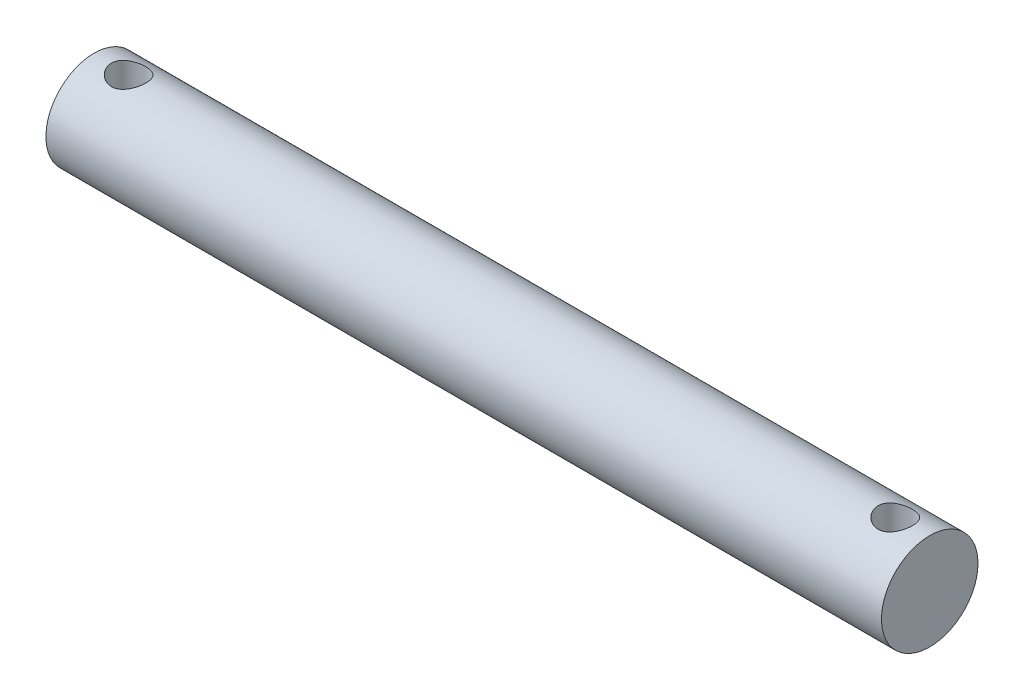
ISO-10303-21;
HEADER;
FILE_DESCRIPTION(('STEP AP214'),'2;1');
FILE_NAME('part.step','',(''),(''),'','','');
FILE_SCHEMA(('AUTOMOTIVE_DESIGN { 1 0 10303 214 1 1 1 1 }'));
ENDSEC;
DATA;
#1=APPLICATION_CONTEXT('core data for automotive mechanical design processes');
#2=APPLICATION_PROTOCOL_DEFINITION('international standard','automotive_design',2000,#1);
#3=PRODUCT_CONTEXT('',#1,'mechanical');
#4=PRODUCT('Part','Part','',(#3));
#5=PRODUCT_RELATED_PRODUCT_CATEGORY('part','',(#4));
#6=PRODUCT_DEFINITION_FORMATION('','',#4);
#7=PRODUCT_DEFINITION_CONTEXT('part definition',#1,'design');
#8=PRODUCT_DEFINITION('design','',#6,#7);
#9=PRODUCT_DEFINITION_SHAPE('','',#8);
#10=(LENGTH_UNIT() NAMED_UNIT(*) SI_UNIT(.MILLI.,.METRE.));
#11=(NAMED_UNIT(*) PLANE_ANGLE_UNIT() SI_UNIT($,.RADIAN.));
#12=(NAMED_UNIT(*) SI_UNIT($,.STERADIAN.) SOLID_ANGLE_UNIT());
#13=UNCERTAINTY_MEASURE_WITH_UNIT(LENGTH_MEASURE(1.E-05),#10,'distance_accuracy_value','');
#14=(GEOMETRIC_REPRESENTATION_CONTEXT(3) GLOBAL_UNCERTAINTY_ASSIGNED_CONTEXT((#13)) GLOBAL_UNIT_ASSIGNED_CONTEXT((#10,
#11,#12)) REPRESENTATION_CONTEXT('',''));
#15=CARTESIAN_POINT('',(0.,0.,0.));
#16=DIRECTION('',(0.,0.,1.));
#17=DIRECTION('',(1.,0.,0.));
#18=AXIS2_PLACEMENT_3D('',#15,#16,#17);
#19=CARTESIAN_POINT('',(38.481,0.,0.));
#20=DIRECTION('',(-1.,0.,0.));
#21=DIRECTION('',(0.,0.,1.));
#22=AXIS2_PLACEMENT_3D('',#19,#20,#21);
#23=CYLINDRICAL_SURFACE('',#22,4.445);
#24=CARTESIAN_POINT('',(-35.306,-4.15185124372249,1.5875));
#25=CARTESIAN_POINT('',(-35.2199403153724,-4.15184961363661,1.58750186145511));
#26=CARTESIAN_POINT('',(-35.1338934965686,-4.15455616835706,1.58047848396243));
#27=CARTESIAN_POINT('',(-34.9643744964137,-4.16502288196892,1.55268356499295));
#28=CARTESIAN_POINT('',(-34.8809024424381,-4.17278329045961,1.53191134448871));
#29=CARTESIAN_POINT('',(-34.7190220280101,-4.19236894394199,1.47746203514562));
#30=CARTESIAN_POINT('',(-34.6406029711052,-4.20418524334939,1.44381332779936));
#31=CARTESIAN_POINT('',(-34.4904943483124,-4.23053749931584,1.36466530894206));
#32=CARTESIAN_POINT('',(-34.4188065931905,-4.24507418454743,1.3191628210377));
#33=CARTESIAN_POINT('',(-34.2809695386923,-4.27596256981786,1.21540554219155));
#34=CARTESIAN_POINT('',(-34.2151666075899,-4.29236418275633,1.15670535812412));
#35=CARTESIAN_POINT('',(-34.094098151087,-4.32471563521184,1.02916641510783));
#36=CARTESIAN_POINT('',(-34.0388346150267,-4.34066538895641,0.960325746451902));
#37=CARTESIAN_POINT('',(-33.9387884298486,-4.37090247101428,0.81187345728735));
#38=CARTESIAN_POINT('',(-33.8943762723068,-4.38512436926321,0.731997639191119));
#39=CARTESIAN_POINT('',(-33.8197602397867,-4.40970864795004,0.565311965269056));
#40=CARTESIAN_POINT('',(-33.7895519277029,-4.42007223346618,0.478504284797408));
#41=CARTESIAN_POINT('',(-33.745397997512,-4.43541824115144,0.304056241422309));
#42=CARTESIAN_POINT('',(-33.7308573792504,-4.44059696934818,0.216584076105372));
#43=CARTESIAN_POINT('',(-33.7165515724594,-4.44569086669573,0.0402981929925169));
#44=CARTESIAN_POINT('',(-33.7167820229602,-4.44560758938665,-0.0485151211045228));
#45=CARTESIAN_POINT('',(-33.7316516104535,-4.44031535586951,-0.220721157169038));
#46=CARTESIAN_POINT('',(-33.7456427615527,-4.43533691376078,-0.304178113904802));
#47=CARTESIAN_POINT('',(-33.7865547604759,-4.42111035951306,-0.467470573630688));
#48=CARTESIAN_POINT('',(-33.8134765111196,-4.41186194924493,-0.547305823325742));
#49=CARTESIAN_POINT('',(-33.8798197915494,-4.38985982444158,-0.702412213924163));
#50=CARTESIAN_POINT('',(-33.919411312042,-4.37705877358586,-0.777603652980376));
#51=CARTESIAN_POINT('',(-34.0098247539622,-4.34926332268646,-0.920454849377235));
#52=CARTESIAN_POINT('',(-34.0606500975727,-4.33426825474632,-0.988112302158894));
#53=CARTESIAN_POINT('',(-34.1752750427185,-4.3026987456317,-1.11781112500373));
#54=CARTESIAN_POINT('',(-34.2396234827347,-4.28608272826663,-1.17935805699104));
#55=CARTESIAN_POINT('',(-34.3778481145109,-4.25380126113165,-1.29096205409802));
#56=CARTESIAN_POINT('',(-34.4517262573262,-4.23813600698386,-1.3410167605171));
#57=CARTESIAN_POINT('',(-34.6086923089919,-4.20928243980775,-1.42904147223294));
#58=CARTESIAN_POINT('',(-34.691925197268,-4.19614525667899,-1.46677102986788));
#59=CARTESIAN_POINT('',(-34.8641539520802,-4.17442484654723,-1.52749952679716));
#60=CARTESIAN_POINT('',(-34.9531469433922,-4.16583936688029,-1.55050575392142));
#61=CARTESIAN_POINT('',(-35.1295232674423,-4.1547161351662,-1.58006234701041));
#62=CARTESIAN_POINT('',(-35.216758251045,-4.15189299388976,-1.58739017478792));
#63=CARTESIAN_POINT('',(-35.3912381932682,-4.15181045854302,-1.5876073013021));
#64=CARTESIAN_POINT('',(-35.478483145569,-4.15454985177955,-1.58049974710939));
#65=CARTESIAN_POINT('',(-35.6467243469504,-4.16499614614501,-1.55275025711288));
#66=CARTESIAN_POINT('',(-35.727829702171,-4.17249240143436,-1.53268163102879));
#67=CARTESIAN_POINT('',(-35.8854945960213,-4.19136588020112,-1.48028611708297));
#68=CARTESIAN_POINT('',(-35.9620532535496,-4.20274385305131,-1.44795686214945));
#69=CARTESIAN_POINT('',(-36.1114341127048,-4.22859135152075,-1.37067546211526));
#70=CARTESIAN_POINT('',(-36.1840309628719,-4.24315534286961,-1.32532021898191));
#71=CARTESIAN_POINT('',(-36.32086190271,-4.27356458881016,-1.2237152069167));
#72=CARTESIAN_POINT('',(-36.3850931740309,-4.28941027230238,-1.16746178220034));
#73=CARTESIAN_POINT('',(-36.5071296081476,-4.32168024689205,-1.04188922622757));
#74=CARTESIAN_POINT('',(-36.5643664097688,-4.33808662434348,-0.972011338061232));
#75=CARTESIAN_POINT('',(-36.6663558550072,-4.36876018149844,-0.823237586208087));
#76=CARTESIAN_POINT('',(-36.7111087072934,-4.3830273969562,-0.744341873285213));
#77=CARTESIAN_POINT('',(-36.7865026418642,-4.40777619941438,-0.579996600943282));
#78=CARTESIAN_POINT('',(-36.8172149210875,-4.41827682623921,-0.494582728970091));
#79=CARTESIAN_POINT('',(-36.8636847555013,-4.43438493349275,-0.319345880815307));
#80=CARTESIAN_POINT('',(-36.8794486082962,-4.43999447440086,-0.229524778139306));
#81=CARTESIAN_POINT('',(-36.8949433338191,-4.44551042495457,-0.053186018396698));
#82=CARTESIAN_POINT('',(-36.8954850775951,-4.44570526545826,0.0332520607219783));
#83=CARTESIAN_POINT('',(-36.8825682356134,-4.44110341833066,0.204931520344084));
#84=CARTESIAN_POINT('',(-36.8691110823032,-4.43630724140882,0.290173022383648));
#85=CARTESIAN_POINT('',(-36.8291363178973,-4.42238327531985,0.455283139679928));
#86=CARTESIAN_POINT('',(-36.802891390661,-4.4133460633109,0.535225978059553));
#87=CARTESIAN_POINT('',(-36.7383484873859,-4.39187518688631,0.689591860756163));
#88=CARTESIAN_POINT('',(-36.7000482528469,-4.37944088610115,0.764013867542668));
#89=CARTESIAN_POINT('',(-36.6107272912744,-4.35181686458272,0.908483284677039));
#90=CARTESIAN_POINT('',(-36.5592585583125,-4.33653673686909,0.978236136617502));
#91=CARTESIAN_POINT('',(-36.4457916884133,-4.30511614240119,1.10837248020741));
#92=CARTESIAN_POINT('',(-36.3837899528847,-4.28897538291027,1.16875275618678));
#93=CARTESIAN_POINT('',(-36.2475660447444,-4.25674081239818,1.28131710248981));
#94=CARTESIAN_POINT('',(-36.1729084278387,-4.24068438756024,1.33298679430306));
#95=CARTESIAN_POINT('',(-36.015461106913,-4.21132223267718,1.4230400724509));
#96=CARTESIAN_POINT('',(-35.9326719519827,-4.19801631708943,1.46142455509107));
#97=CARTESIAN_POINT('',(-35.7608245133623,-4.17581850400451,1.52370366586655));
#98=CARTESIAN_POINT('',(-35.6717417079496,-4.16694509766434,1.54753768390296));
#99=CARTESIAN_POINT('',(-35.4904332776075,-4.15496378760329,1.57943089514111));
#100=CARTESIAN_POINT('',(-35.3982092536912,-4.15185299028947,1.58749800553085));
#101=CARTESIAN_POINT('',(-35.306,-4.15185124372249,1.5875));
#102=B_SPLINE_CURVE_WITH_KNOTS('',3,(#24,#25,#26,#27,#28,#29,#30,#31,#32,#33,#34,#35,#36,#37,
#38,#39,#40,#41,#42,#43,#44,#45,#46,#47,#48,#49,#50,#51,#52,#53,#54,#55,#56,#57,#58,#59,#60,#61,
#62,#63,#64,#65,#66,#67,#68,#69,#70,#71,#72,#73,#74,#75,#76,#77,#78,#79,#80,#81,#82,#83,#84,#85,
#86,#87,#88,#89,#90,#91,#92,#93,#94,#95,#96,#97,#98,#99,#100,#101),.UNSPECIFIED.,.T.,.F.,(4,2,2,
2,2,2,2,2,2,2,2,2,2,2,2,2,2,2,2,2,2,2,2,2,2,2,2,2,2,2,2,2,2,2,2,2,2,2,4),(0.,0.257836521620191,
0.515685778212971,0.772969944043844,1.03032312396152,1.29820036606624,1.56612812081067,
1.84221636695862,2.11821830916116,2.38332302248934,2.64834946739267,2.90146573215882,
3.15459967217287,3.41128331629248,3.66804526251997,3.93855046536393,4.20911113801567,
4.48467231908919,4.76009699575778,5.02151303029342,5.28287207940178,5.53339598066458,
5.7839682734251,6.04333237571293,6.30278363255788,6.57689850681361,6.85100879896744,
7.12371328046841,7.39630282352083,7.65434251544725,7.912355805872,8.16509329922164,
8.41787816985807,8.68078665230694,8.94378513852369,9.21906437979767,9.49432504534311,
9.77072462467386,10.0469853771484),.UNSPECIFIED.);
#103=CARTESIAN_POINT('',(-35.306,-4.15185124372249,1.5875));
#104=VERTEX_POINT('',#103);
#105=EDGE_CURVE('E10',#104,#104,#102,.T.);
#106=ORIENTED_EDGE('',*,*,#105,.T.);
#107=EDGE_LOOP('',(#106));
#108=FACE_BOUND('',#107,.T.);
#109=CARTESIAN_POINT('',(-35.306,4.15185124372249,1.5875));
#110=CARTESIAN_POINT('',(-35.3920596846276,4.15184961363661,1.58750186145511));
#111=CARTESIAN_POINT('',(-35.4781065034314,4.15455616835706,1.58047848396243));
#112=CARTESIAN_POINT('',(-35.6476255035863,4.16502288196892,1.55268356499295));
#113=CARTESIAN_POINT('',(-35.7310975575619,4.17278329045961,1.53191134448871));
#114=CARTESIAN_POINT('',(-35.8929779719899,4.19236894394199,1.47746203514562));
#115=CARTESIAN_POINT('',(-35.9713970288948,4.20418524334939,1.44381332779936));
#116=CARTESIAN_POINT('',(-36.1215056516876,4.23053749931584,1.36466530894206));
#117=CARTESIAN_POINT('',(-36.1931934068095,4.24507418454743,1.3191628210377));
#118=CARTESIAN_POINT('',(-36.3310304613077,4.27596256981786,1.21540554219155));
#119=CARTESIAN_POINT('',(-36.3968333924101,4.29236418275633,1.15670535812412));
#120=CARTESIAN_POINT('',(-36.5179018489129,4.32471563521184,1.02916641510783));
#121=CARTESIAN_POINT('',(-36.5731653849733,4.34066538895641,0.960325746451902));
#122=CARTESIAN_POINT('',(-36.6732115701514,4.37090247101428,0.81187345728735));
#123=CARTESIAN_POINT('',(-36.7176237276932,4.38512436926321,0.731997639191119));
#124=CARTESIAN_POINT('',(-36.7922397602132,4.40970864795004,0.565311965269056));
#125=CARTESIAN_POINT('',(-36.8224480722971,4.42007223346618,0.478504284797408));
#126=CARTESIAN_POINT('',(-36.866602002488,4.43541824115144,0.304056241422309));
#127=CARTESIAN_POINT('',(-36.8811426207496,4.44059696934818,0.216584076105371));
#128=CARTESIAN_POINT('',(-36.8954484275406,4.44569086669573,0.0402981929925166));
#129=CARTESIAN_POINT('',(-36.8952179770398,4.44560758938665,-0.048515121104523));
#130=CARTESIAN_POINT('',(-36.8803483895465,4.44031535586951,-0.220721157169038));
#131=CARTESIAN_POINT('',(-36.8663572384473,4.43533691376078,-0.304178113904802));
#132=CARTESIAN_POINT('',(-36.8254452395241,4.42111035951306,-0.467470573630688));
#133=CARTESIAN_POINT('',(-36.7985234888804,4.41186194924493,-0.547305823325742));
#134=CARTESIAN_POINT('',(-36.7321802084506,4.38985982444158,-0.702412213924163));
#135=CARTESIAN_POINT('',(-36.692588687958,4.37705877358586,-0.777603652980376));
#136=CARTESIAN_POINT('',(-36.6021752460378,4.34926332268646,-0.920454849377235));
#137=CARTESIAN_POINT('',(-36.5513499024273,4.33426825474632,-0.988112302158894));
#138=CARTESIAN_POINT('',(-36.4367249572815,4.3026987456317,-1.11781112500373));
#139=CARTESIAN_POINT('',(-36.3723765172653,4.28608272826663,-1.17935805699103));
#140=CARTESIAN_POINT('',(-36.2341518854891,4.25380126113165,-1.29096205409801));
#141=CARTESIAN_POINT('',(-36.1602737426738,4.23813600698386,-1.3410167605171));
#142=CARTESIAN_POINT('',(-36.0033076910081,4.20928243980775,-1.42904147223294));
#143=CARTESIAN_POINT('',(-35.920074802732,4.19614525667899,-1.46677102986788));
#144=CARTESIAN_POINT('',(-35.7478460479198,4.17442484654723,-1.52749952679716));
#145=CARTESIAN_POINT('',(-35.6588530566078,4.16583936688029,-1.55050575392142));
#146=CARTESIAN_POINT('',(-35.4824767325577,4.1547161351662,-1.58006234701041));
#147=CARTESIAN_POINT('',(-35.395241748955,4.15189299388976,-1.58739017478792));
#148=CARTESIAN_POINT('',(-35.2207618067318,4.15181045854302,-1.5876073013021));
#149=CARTESIAN_POINT('',(-35.133516854431,4.15454985177955,-1.58049974710939));
#150=CARTESIAN_POINT('',(-34.9652756530496,4.16499614614501,-1.55275025711288));
#151=CARTESIAN_POINT('',(-34.884170297829,4.17249240143436,-1.53268163102879));
#152=CARTESIAN_POINT('',(-34.7265054039787,4.19136588020112,-1.48028611708297));
#153=CARTESIAN_POINT('',(-34.6499467464504,4.20274385305131,-1.44795686214945));
#154=CARTESIAN_POINT('',(-34.5005658872952,4.22859135152075,-1.37067546211526));
#155=CARTESIAN_POINT('',(-34.4279690371281,4.24315534286961,-1.32532021898191));
#156=CARTESIAN_POINT('',(-34.29113809729,4.27356458881016,-1.2237152069167));
#157=CARTESIAN_POINT('',(-34.2269068259691,4.28941027230238,-1.16746178220034));
#158=CARTESIAN_POINT('',(-34.1048703918524,4.32168024689205,-1.04188922622757));
#159=CARTESIAN_POINT('',(-34.0476335902312,4.33808662434348,-0.972011338061232));
#160=CARTESIAN_POINT('',(-33.9456441449928,4.36876018149844,-0.823237586208087));
#161=CARTESIAN_POINT('',(-33.9008912927066,4.3830273969562,-0.744341873285213));
#162=CARTESIAN_POINT('',(-33.8254973581358,4.40777619941438,-0.579996600943282));
#163=CARTESIAN_POINT('',(-33.7947850789125,4.41827682623921,-0.494582728970091));
#164=CARTESIAN_POINT('',(-33.7483152444987,4.43438493349275,-0.319345880815307));
#165=CARTESIAN_POINT('',(-33.7325513917038,4.43999447440086,-0.229524778139306));
#166=CARTESIAN_POINT('',(-33.7170566661809,4.44551042495457,-0.053186018396698));
#167=CARTESIAN_POINT('',(-33.7165149224049,4.44570526545826,0.0332520607219783));
#168=CARTESIAN_POINT('',(-33.7294317643866,4.44110341833066,0.204931520344084));
#169=CARTESIAN_POINT('',(-33.7428889176968,4.43630724140882,0.290173022383648));
#170=CARTESIAN_POINT('',(-33.7828636821027,4.42238327531985,0.455283139679928));
#171=CARTESIAN_POINT('',(-33.809108609339,4.4133460633109,0.535225978059553));
#172=CARTESIAN_POINT('',(-33.8736515126141,4.39187518688631,0.689591860756163));
#173=CARTESIAN_POINT('',(-33.9119517471531,4.37944088610115,0.764013867542668));
#174=CARTESIAN_POINT('',(-34.0012727087256,4.35181686458272,0.908483284677037));
#175=CARTESIAN_POINT('',(-34.0527414416875,4.33653673686909,0.978236136617497));
#176=CARTESIAN_POINT('',(-34.1662083115867,4.30511614240119,1.1083724802074));
#177=CARTESIAN_POINT('',(-34.2282100471153,4.28897538291027,1.16875275618678));
#178=CARTESIAN_POINT('',(-34.3644339552556,4.25674081239818,1.28131710248981));
#179=CARTESIAN_POINT('',(-34.4390915721613,4.24068438756024,1.33298679430306));
#180=CARTESIAN_POINT('',(-34.596538893087,4.21132223267718,1.4230400724509));
#181=CARTESIAN_POINT('',(-34.6793280480173,4.19801631708943,1.46142455509107));
#182=CARTESIAN_POINT('',(-34.8511754866377,4.17581850400451,1.52370366586655));
#183=CARTESIAN_POINT('',(-34.9402582920504,4.16694509766434,1.54753768390296));
#184=CARTESIAN_POINT('',(-35.1215667223925,4.15496378760329,1.57943089514111));
#185=CARTESIAN_POINT('',(-35.2137907463088,4.15185299028947,1.58749800553085));
#186=CARTESIAN_POINT('',(-35.306,4.15185124372249,1.5875));
#187=B_SPLINE_CURVE_WITH_KNOTS('',3,(#109,#110,#111,#112,#113,#114,#115,#116,#117,#118,#119,
#120,#121,#122,#123,#124,#125,#126,#127,#128,#129,#130,#131,#132,#133,#134,#135,#136,#137,#138,
#139,#140,#141,#142,#143,#144,#145,#146,#147,#148,#149,#150,#151,#152,#153,#154,#155,#156,#157,
#158,#159,#160,#161,#162,#163,#164,#165,#166,#167,#168,#169,#170,#171,#172,#173,#174,#175,#176,
#177,#178,#179,#180,#181,#182,#183,#184,#185,#186),.UNSPECIFIED.,.T.,.F.,(4,2,2,2,2,2,2,2,2,2,2,
2,2,2,2,2,2,2,2,2,2,2,2,2,2,2,2,2,2,2,2,2,2,2,2,2,2,2,4),(0.,0.257836521620191,
0.515685778212971,0.772969944043844,1.03032312396152,1.29820036606624,1.56612812081067,
1.84221636695862,2.11821830916116,2.38332302248934,2.64834946739267,2.90146573215882,
3.15459967217287,3.41128331629248,3.66804526251997,3.93855046536392,4.20911113801567,
4.48467231908919,4.76009699575779,5.02151303029342,5.28287207940178,5.53339598066459,
5.78396827342511,6.04333237571293,6.30278363255788,6.57689850681361,6.85100879896744,
7.12371328046841,7.39630282352083,7.65434251544725,7.912355805872,8.16509329922165,
8.41787816985807,8.68078665230693,8.94378513852369,9.21906437979767,9.49432504534311,
9.77072462467386,10.0469853771484),.UNSPECIFIED.);
#188=CARTESIAN_POINT('',(-35.306,4.15185124372249,1.5875));
#189=VERTEX_POINT('',#188);
#190=EDGE_CURVE('E44',#189,#189,#187,.T.);
#191=ORIENTED_EDGE('',*,*,#190,.T.);
#192=EDGE_LOOP('',(#191));
#193=FACE_BOUND('',#192,.T.);
#194=CARTESIAN_POINT('',(35.306,-4.15185124372249,1.5875));
#195=CARTESIAN_POINT('',(35.3920596846276,-4.15184961363661,1.58750186145511));
#196=CARTESIAN_POINT('',(35.4781065034314,-4.15455616835706,1.58047848396243));
#197=CARTESIAN_POINT('',(35.6476255035863,-4.16502288196892,1.55268356499295));
#198=CARTESIAN_POINT('',(35.7310975575619,-4.17278329045961,1.53191134448871));
#199=CARTESIAN_POINT('',(35.8929779719899,-4.19236894394199,1.47746203514562));
#200=CARTESIAN_POINT('',(35.9713970288948,-4.20418524334939,1.44381332779936));
#201=CARTESIAN_POINT('',(36.1215056516876,-4.23053749931584,1.36466530894206));
#202=CARTESIAN_POINT('',(36.1931934068095,-4.24507418454743,1.3191628210377));
#203=CARTESIAN_POINT('',(36.3310304613077,-4.27596256981786,1.21540554219155));
#204=CARTESIAN_POINT('',(36.3968333924101,-4.29236418275633,1.15670535812412));
#205=CARTESIAN_POINT('',(36.5179018489129,-4.32471563521184,1.02916641510783));
#206=CARTESIAN_POINT('',(36.5731653849733,-4.34066538895641,0.960325746451902));
#207=CARTESIAN_POINT('',(36.6732115701514,-4.37090247101428,0.81187345728735));
#208=CARTESIAN_POINT('',(36.7176237276932,-4.38512436926321,0.731997639191119));
#209=CARTESIAN_POINT('',(36.7922397602132,-4.40970864795004,0.565311965269056));
#210=CARTESIAN_POINT('',(36.8224480722971,-4.42007223346618,0.478504284797408));
#211=CARTESIAN_POINT('',(36.866602002488,-4.43541824115144,0.304056241422309));
#212=CARTESIAN_POINT('',(36.8811426207496,-4.44059696934818,0.216584076105371));
#213=CARTESIAN_POINT('',(36.8954484275406,-4.44569086669573,0.0402981929925166));
#214=CARTESIAN_POINT('',(36.8952179770398,-4.44560758938665,-0.048515121104523));
#215=CARTESIAN_POINT('',(36.8803483895465,-4.44031535586951,-0.220721157169038));
#216=CARTESIAN_POINT('',(36.8663572384473,-4.43533691376078,-0.304178113904802));
#217=CARTESIAN_POINT('',(36.8254452395241,-4.42111035951306,-0.467470573630688));
#218=CARTESIAN_POINT('',(36.7985234888804,-4.41186194924493,-0.547305823325742));
#219=CARTESIAN_POINT('',(36.7321802084506,-4.38985982444158,-0.702412213924163));
#220=CARTESIAN_POINT('',(36.692588687958,-4.37705877358586,-0.777603652980376));
#221=CARTESIAN_POINT('',(36.6021752460378,-4.34926332268646,-0.920454849377235));
#222=CARTESIAN_POINT('',(36.5513499024273,-4.33426825474632,-0.988112302158894));
#223=CARTESIAN_POINT('',(36.4367249572815,-4.3026987456317,-1.11781112500373));
#224=CARTESIAN_POINT('',(36.3723765172653,-4.28608272826663,-1.17935805699103));
#225=CARTESIAN_POINT('',(36.2341518854891,-4.25380126113165,-1.29096205409801));
#226=CARTESIAN_POINT('',(36.1602737426738,-4.23813600698386,-1.3410167605171));
#227=CARTESIAN_POINT('',(36.0033076910081,-4.20928243980775,-1.42904147223294));
#228=CARTESIAN_POINT('',(35.920074802732,-4.19614525667899,-1.46677102986788));
#229=CARTESIAN_POINT('',(35.7478460479198,-4.17442484654723,-1.52749952679716));
#230=CARTESIAN_POINT('',(35.6588530566078,-4.16583936688029,-1.55050575392142));
#231=CARTESIAN_POINT('',(35.4824767325577,-4.1547161351662,-1.58006234701041));
#232=CARTESIAN_POINT('',(35.395241748955,-4.15189299388976,-1.58739017478792));
#233=CARTESIAN_POINT('',(35.2207618067318,-4.15181045854302,-1.5876073013021));
#234=CARTESIAN_POINT('',(35.133516854431,-4.15454985177955,-1.58049974710939));
#235=CARTESIAN_POINT('',(34.9652756530496,-4.16499614614501,-1.55275025711288));
#236=CARTESIAN_POINT('',(34.884170297829,-4.17249240143436,-1.53268163102879));
#237=CARTESIAN_POINT('',(34.7265054039787,-4.19136588020112,-1.48028611708297));
#238=CARTESIAN_POINT('',(34.6499467464504,-4.20274385305131,-1.44795686214945));
#239=CARTESIAN_POINT('',(34.5005658872952,-4.22859135152075,-1.37067546211526));
#240=CARTESIAN_POINT('',(34.4279690371281,-4.24315534286961,-1.32532021898191));
#241=CARTESIAN_POINT('',(34.29113809729,-4.27356458881016,-1.2237152069167));
#242=CARTESIAN_POINT('',(34.2269068259691,-4.28941027230238,-1.16746178220034));
#243=CARTESIAN_POINT('',(34.1048703918524,-4.32168024689205,-1.04188922622757));
#244=CARTESIAN_POINT('',(34.0476335902312,-4.33808662434348,-0.972011338061232));
#245=CARTESIAN_POINT('',(33.9456441449928,-4.36876018149844,-0.823237586208087));
#246=CARTESIAN_POINT('',(33.9008912927066,-4.3830273969562,-0.744341873285213));
#247=CARTESIAN_POINT('',(33.8254973581358,-4.40777619941438,-0.579996600943282));
#248=CARTESIAN_POINT('',(33.7947850789125,-4.41827682623921,-0.494582728970091));
#249=CARTESIAN_POINT('',(33.7483152444987,-4.43438493349275,-0.319345880815307));
#250=CARTESIAN_POINT('',(33.7325513917038,-4.43999447440086,-0.229524778139306));
#251=CARTESIAN_POINT('',(33.7170566661809,-4.44551042495457,-0.053186018396698));
#252=CARTESIAN_POINT('',(33.7165149224049,-4.44570526545826,0.0332520607219783));
#253=CARTESIAN_POINT('',(33.7294317643866,-4.44110341833066,0.204931520344084));
#254=CARTESIAN_POINT('',(33.7428889176968,-4.43630724140882,0.290173022383648));
#255=CARTESIAN_POINT('',(33.7828636821027,-4.42238327531985,0.455283139679928));
#256=CARTESIAN_POINT('',(33.809108609339,-4.4133460633109,0.535225978059553));
#257=CARTESIAN_POINT('',(33.8736515126141,-4.39187518688631,0.689591860756163));
#258=CARTESIAN_POINT('',(33.9119517471531,-4.37944088610115,0.764013867542668));
#259=CARTESIAN_POINT('',(34.0012727087256,-4.35181686458272,0.908483284677037));
#260=CARTESIAN_POINT('',(34.0527414416875,-4.33653673686909,0.978236136617497));
#261=CARTESIAN_POINT('',(34.1662083115867,-4.30511614240119,1.1083724802074));
#262=CARTESIAN_POINT('',(34.2282100471153,-4.28897538291027,1.16875275618678));
#263=CARTESIAN_POINT('',(34.3644339552556,-4.25674081239818,1.28131710248981));
#264=CARTESIAN_POINT('',(34.4390915721613,-4.24068438756024,1.33298679430306));
#265=CARTESIAN_POINT('',(34.596538893087,-4.21132223267718,1.4230400724509));
#266=CARTESIAN_POINT('',(34.6793280480173,-4.19801631708943,1.46142455509107));
#267=CARTESIAN_POINT('',(34.8511754866377,-4.17581850400451,1.52370366586655));
#268=CARTESIAN_POINT('',(34.9402582920504,-4.16694509766434,1.54753768390296));
#269=CARTESIAN_POINT('',(35.1215667223925,-4.15496378760329,1.57943089514111));
#270=CARTESIAN_POINT('',(35.2137907463088,-4.15185299028947,1.58749800553085));
#271=CARTESIAN_POINT('',(35.306,-4.15185124372249,1.5875));
#272=B_SPLINE_CURVE_WITH_KNOTS('',3,(#194,#195,#196,#197,#198,#199,#200,#201,#202,#203,#204,
#205,#206,#207,#208,#209,#210,#211,#212,#213,#214,#215,#216,#217,#218,#219,#220,#221,#222,#223,
#224,#225,#226,#227,#228,#229,#230,#231,#232,#233,#234,#235,#236,#237,#238,#239,#240,#241,#242,
#243,#244,#245,#246,#247,#248,#249,#250,#251,#252,#253,#254,#255,#256,#257,#258,#259,#260,#261,
#262,#263,#264,#265,#266,#267,#268,#269,#270,#271),.UNSPECIFIED.,.T.,.F.,(4,2,2,2,2,2,2,2,2,2,2,
2,2,2,2,2,2,2,2,2,2,2,2,2,2,2,2,2,2,2,2,2,2,2,2,2,2,2,4),(0.,0.257836521620191,
0.515685778212971,0.772969944043844,1.03032312396152,1.29820036606624,1.56612812081067,
1.84221636695862,2.11821830916116,2.38332302248934,2.64834946739267,2.90146573215882,
3.15459967217287,3.41128331629248,3.66804526251997,3.93855046536392,4.20911113801567,
4.48467231908919,4.76009699575779,5.02151303029342,5.28287207940178,5.53339598066459,
5.78396827342511,6.04333237571293,6.30278363255788,6.57689850681361,6.85100879896744,
7.12371328046841,7.39630282352083,7.65434251544725,7.912355805872,8.16509329922165,
8.41787816985807,8.68078665230693,8.94378513852369,9.21906437979767,9.49432504534311,
9.77072462467386,10.0469853771484),.UNSPECIFIED.);
#273=CARTESIAN_POINT('',(35.306,-4.15185124372249,1.5875));
#274=VERTEX_POINT('',#273);
#275=EDGE_CURVE('E48',#274,#274,#272,.T.);
#276=ORIENTED_EDGE('',*,*,#275,.T.);
#277=EDGE_LOOP('',(#276));
#278=FACE_BOUND('',#277,.T.);
#279=CARTESIAN_POINT('',(35.306,4.15185124372249,1.5875));
#280=CARTESIAN_POINT('',(35.2199403153724,4.15184961363661,1.58750186145511));
#281=CARTESIAN_POINT('',(35.1338934965686,4.15455616835706,1.58047848396243));
#282=CARTESIAN_POINT('',(34.9643744964137,4.16502288196892,1.55268356499295));
#283=CARTESIAN_POINT('',(34.8809024424381,4.17278329045961,1.53191134448871));
#284=CARTESIAN_POINT('',(34.7190220280101,4.19236894394199,1.47746203514562));
#285=CARTESIAN_POINT('',(34.6406029711052,4.20418524334939,1.44381332779936));
#286=CARTESIAN_POINT('',(34.4904943483124,4.23053749931584,1.36466530894206));
#287=CARTESIAN_POINT('',(34.4188065931905,4.24507418454743,1.3191628210377));
#288=CARTESIAN_POINT('',(34.2809695386923,4.27596256981786,1.21540554219155));
#289=CARTESIAN_POINT('',(34.2151666075899,4.29236418275633,1.15670535812412));
#290=CARTESIAN_POINT('',(34.094098151087,4.32471563521184,1.02916641510783));
#291=CARTESIAN_POINT('',(34.0388346150267,4.34066538895641,0.960325746451902));
#292=CARTESIAN_POINT('',(33.9387884298486,4.37090247101428,0.81187345728735));
#293=CARTESIAN_POINT('',(33.8943762723068,4.38512436926321,0.731997639191119));
#294=CARTESIAN_POINT('',(33.8197602397867,4.40970864795004,0.565311965269056));
#295=CARTESIAN_POINT('',(33.7895519277029,4.42007223346618,0.478504284797408));
#296=CARTESIAN_POINT('',(33.745397997512,4.43541824115144,0.304056241422309));
#297=CARTESIAN_POINT('',(33.7308573792504,4.44059696934818,0.216584076105372));
#298=CARTESIAN_POINT('',(33.7165515724594,4.44569086669573,0.0402981929925169));
#299=CARTESIAN_POINT('',(33.7167820229602,4.44560758938665,-0.0485151211045228));
#300=CARTESIAN_POINT('',(33.7316516104535,4.44031535586951,-0.220721157169038));
#301=CARTESIAN_POINT('',(33.7456427615527,4.43533691376078,-0.304178113904802));
#302=CARTESIAN_POINT('',(33.7865547604759,4.42111035951306,-0.467470573630688));
#303=CARTESIAN_POINT('',(33.8134765111196,4.41186194924493,-0.547305823325742));
#304=CARTESIAN_POINT('',(33.8798197915494,4.38985982444158,-0.702412213924163));
#305=CARTESIAN_POINT('',(33.919411312042,4.37705877358586,-0.777603652980376));
#306=CARTESIAN_POINT('',(34.0098247539622,4.34926332268646,-0.920454849377235));
#307=CARTESIAN_POINT('',(34.0606500975727,4.33426825474632,-0.988112302158894));
#308=CARTESIAN_POINT('',(34.1752750427185,4.3026987456317,-1.11781112500373));
#309=CARTESIAN_POINT('',(34.2396234827347,4.28608272826663,-1.17935805699104));
#310=CARTESIAN_POINT('',(34.3778481145109,4.25380126113165,-1.29096205409802));
#311=CARTESIAN_POINT('',(34.4517262573262,4.23813600698386,-1.3410167605171));
#312=CARTESIAN_POINT('',(34.6086923089919,4.20928243980775,-1.42904147223294));
#313=CARTESIAN_POINT('',(34.691925197268,4.19614525667899,-1.46677102986788));
#314=CARTESIAN_POINT('',(34.8641539520802,4.17442484654723,-1.52749952679716));
#315=CARTESIAN_POINT('',(34.9531469433922,4.16583936688029,-1.55050575392142));
#316=CARTESIAN_POINT('',(35.1295232674423,4.1547161351662,-1.58006234701041));
#317=CARTESIAN_POINT('',(35.216758251045,4.15189299388976,-1.58739017478792));
#318=CARTESIAN_POINT('',(35.3912381932682,4.15181045854302,-1.5876073013021));
#319=CARTESIAN_POINT('',(35.478483145569,4.15454985177955,-1.58049974710939));
#320=CARTESIAN_POINT('',(35.6467243469504,4.16499614614501,-1.55275025711288));
#321=CARTESIAN_POINT('',(35.727829702171,4.17249240143436,-1.53268163102879));
#322=CARTESIAN_POINT('',(35.8854945960213,4.19136588020112,-1.48028611708297));
#323=CARTESIAN_POINT('',(35.9620532535496,4.20274385305131,-1.44795686214945));
#324=CARTESIAN_POINT('',(36.1114341127048,4.22859135152075,-1.37067546211526));
#325=CARTESIAN_POINT('',(36.1840309628719,4.24315534286961,-1.32532021898191));
#326=CARTESIAN_POINT('',(36.32086190271,4.27356458881016,-1.2237152069167));
#327=CARTESIAN_POINT('',(36.3850931740309,4.28941027230238,-1.16746178220034));
#328=CARTESIAN_POINT('',(36.5071296081476,4.32168024689205,-1.04188922622757));
#329=CARTESIAN_POINT('',(36.5643664097688,4.33808662434348,-0.972011338061232));
#330=CARTESIAN_POINT('',(36.6663558550072,4.36876018149844,-0.823237586208087));
#331=CARTESIAN_POINT('',(36.7111087072934,4.3830273969562,-0.744341873285213));
#332=CARTESIAN_POINT('',(36.7865026418642,4.40777619941438,-0.579996600943282));
#333=CARTESIAN_POINT('',(36.8172149210875,4.41827682623921,-0.494582728970091));
#334=CARTESIAN_POINT('',(36.8636847555013,4.43438493349275,-0.319345880815307));
#335=CARTESIAN_POINT('',(36.8794486082962,4.43999447440086,-0.229524778139306));
#336=CARTESIAN_POINT('',(36.8949433338191,4.44551042495457,-0.053186018396698));
#337=CARTESIAN_POINT('',(36.8954850775951,4.44570526545826,0.0332520607219783));
#338=CARTESIAN_POINT('',(36.8825682356134,4.44110341833066,0.204931520344084));
#339=CARTESIAN_POINT('',(36.8691110823032,4.43630724140882,0.290173022383648));
#340=CARTESIAN_POINT('',(36.8291363178973,4.42238327531985,0.455283139679928));
#341=CARTESIAN_POINT('',(36.802891390661,4.4133460633109,0.535225978059553));
#342=CARTESIAN_POINT('',(36.7383484873859,4.39187518688631,0.689591860756163));
#343=CARTESIAN_POINT('',(36.7000482528469,4.37944088610115,0.764013867542668));
#344=CARTESIAN_POINT('',(36.6107272912744,4.35181686458272,0.908483284677039));
#345=CARTESIAN_POINT('',(36.5592585583125,4.33653673686909,0.978236136617502));
#346=CARTESIAN_POINT('',(36.4457916884133,4.30511614240119,1.10837248020741));
#347=CARTESIAN_POINT('',(36.3837899528847,4.28897538291027,1.16875275618678));
#348=CARTESIAN_POINT('',(36.2475660447444,4.25674081239818,1.28131710248981));
#349=CARTESIAN_POINT('',(36.1729084278387,4.24068438756024,1.33298679430306));
#350=CARTESIAN_POINT('',(36.015461106913,4.21132223267718,1.4230400724509));
#351=CARTESIAN_POINT('',(35.9326719519827,4.19801631708943,1.46142455509107));
#352=CARTESIAN_POINT('',(35.7608245133623,4.17581850400451,1.52370366586655));
#353=CARTESIAN_POINT('',(35.6717417079496,4.16694509766434,1.54753768390296));
#354=CARTESIAN_POINT('',(35.4904332776075,4.15496378760329,1.57943089514111));
#355=CARTESIAN_POINT('',(35.3982092536912,4.15185299028947,1.58749800553085));
#356=CARTESIAN_POINT('',(35.306,4.15185124372249,1.5875));
#357=B_SPLINE_CURVE_WITH_KNOTS('',3,(#279,#280,#281,#282,#283,#284,#285,#286,#287,#288,#289,
#290,#291,#292,#293,#294,#295,#296,#297,#298,#299,#300,#301,#302,#303,#304,#305,#306,#307,#308,
#309,#310,#311,#312,#313,#314,#315,#316,#317,#318,#319,#320,#321,#322,#323,#324,#325,#326,#327,
#328,#329,#330,#331,#332,#333,#334,#335,#336,#337,#338,#339,#340,#341,#342,#343,#344,#345,#346,
#347,#348,#349,#350,#351,#352,#353,#354,#355,#356),.UNSPECIFIED.,.T.,.F.,(4,2,2,2,2,2,2,2,2,2,2,
2,2,2,2,2,2,2,2,2,2,2,2,2,2,2,2,2,2,2,2,2,2,2,2,2,2,2,4),(0.,0.257836521620191,
0.515685778212971,0.772969944043844,1.03032312396152,1.29820036606624,1.56612812081067,
1.84221636695862,2.11821830916116,2.38332302248934,2.64834946739267,2.90146573215882,
3.15459967217287,3.41128331629248,3.66804526251997,3.93855046536393,4.20911113801567,
4.48467231908919,4.76009699575778,5.02151303029342,5.28287207940178,5.53339598066458,
5.7839682734251,6.04333237571293,6.30278363255788,6.57689850681361,6.85100879896744,
7.12371328046841,7.39630282352083,7.65434251544725,7.912355805872,8.16509329922164,
8.41787816985807,8.68078665230694,8.94378513852369,9.21906437979767,9.49432504534311,
9.77072462467386,10.0469853771484),.UNSPECIFIED.);
#358=CARTESIAN_POINT('',(35.306,4.15185124372249,1.5875));
#359=VERTEX_POINT('',#358);
#360=EDGE_CURVE('E52',#359,#359,#357,.T.);
#361=ORIENTED_EDGE('',*,*,#360,.T.);
#362=EDGE_LOOP('',(#361));
#363=FACE_BOUND('',#362,.T.);
#364=CARTESIAN_POINT('',(38.481,0.,0.));
#365=DIRECTION('',(1.,0.,0.));
#366=DIRECTION('',(0.,0.,-1.));
#367=AXIS2_PLACEMENT_3D('',#364,#365,#366);
#368=CIRCLE('',#367,4.445);
#369=CARTESIAN_POINT('',(38.481,0.,-4.445));
#370=VERTEX_POINT('',#369);
#371=EDGE_CURVE('E80',#370,#370,#368,.T.);
#372=ORIENTED_EDGE('',*,*,#371,.F.);
#373=EDGE_LOOP('',(#372));
#374=FACE_BOUND('',#373,.T.);
#375=CARTESIAN_POINT('',(-38.481,0.,0.));
#376=DIRECTION('',(1.,0.,0.));
#377=DIRECTION('',(0.,0.,-1.));
#378=AXIS2_PLACEMENT_3D('',#375,#376,#377);
#379=CIRCLE('',#378,4.445);
#380=CARTESIAN_POINT('',(-38.481,0.,-4.445));
#381=VERTEX_POINT('',#380);
#382=EDGE_CURVE('E81',#381,#381,#379,.T.);
#383=ORIENTED_EDGE('',*,*,#382,.T.);
#384=EDGE_LOOP('',(#383));
#385=FACE_BOUND('',#384,.T.);
#386=ADVANCED_FACE('F33',(#108,#193,#278,#363,#374,#385),#23,.T.);
#387=CARTESIAN_POINT('',(38.481,0.,0.));
#388=DIRECTION('',(1.,0.,0.));
#389=DIRECTION('',(0.,0.,-1.));
#390=AXIS2_PLACEMENT_3D('',#387,#388,#389);
#391=PLANE('',#390);
#392=ORIENTED_EDGE('',*,*,#371,.T.);
#393=EDGE_LOOP('',(#392));
#394=FACE_BOUND('',#393,.T.);
#395=ADVANCED_FACE('F73',(#394),#391,.T.);
#396=CARTESIAN_POINT('',(-38.481,0.,0.));
#397=DIRECTION('',(1.,0.,0.));
#398=DIRECTION('',(0.,0.,-1.));
#399=AXIS2_PLACEMENT_3D('',#396,#397,#398);
#400=PLANE('',#399);
#401=ORIENTED_EDGE('',*,*,#382,.F.);
#402=EDGE_LOOP('',(#401));
#403=FACE_BOUND('',#402,.T.);
#404=ADVANCED_FACE('F71',(#403),#400,.F.);
#405=CARTESIAN_POINT('',(35.306,-4.445,0.));
#406=DIRECTION('',(0.,1.,0.));
#407=DIRECTION('',(0.,0.,1.));
#408=AXIS2_PLACEMENT_3D('',#405,#406,#407);
#409=CYLINDRICAL_SURFACE('',#408,1.5875);
#410=ORIENTED_EDGE('',*,*,#360,.F.);
#411=EDGE_LOOP('',(#410));
#412=FACE_BOUND('',#411,.T.);
#413=ORIENTED_EDGE('',*,*,#275,.F.);
#414=EDGE_LOOP('',(#413));
#415=FACE_BOUND('',#414,.T.);
#416=ADVANCED_FACE('F65',(#412,#415),#409,.F.);
#417=CARTESIAN_POINT('',(-35.306,-4.445,0.));
#418=DIRECTION('',(0.,1.,0.));
#419=DIRECTION('',(0.,0.,1.));
#420=AXIS2_PLACEMENT_3D('',#417,#418,#419);
#421=CYLINDRICAL_SURFACE('',#420,1.5875);
#422=ORIENTED_EDGE('',*,*,#190,.F.);
#423=EDGE_LOOP('',(#422));
#424=FACE_BOUND('',#423,.T.);
#425=ORIENTED_EDGE('',*,*,#105,.F.);
#426=EDGE_LOOP('',(#425));
#427=FACE_BOUND('',#426,.T.);
#428=ADVANCED_FACE('F62',(#424,#427),#421,.F.);
#429=CLOSED_SHELL('',(#386,#395,#404,#416,#428));
#430=MANIFOLD_SOLID_BREP('B2',#429);
#431=ADVANCED_BREP_SHAPE_REPRESENTATION('',(#18,#430),#14);
#432=SHAPE_DEFINITION_REPRESENTATION(#9,#431);
ENDSEC;
END-ISO-10303-21;
